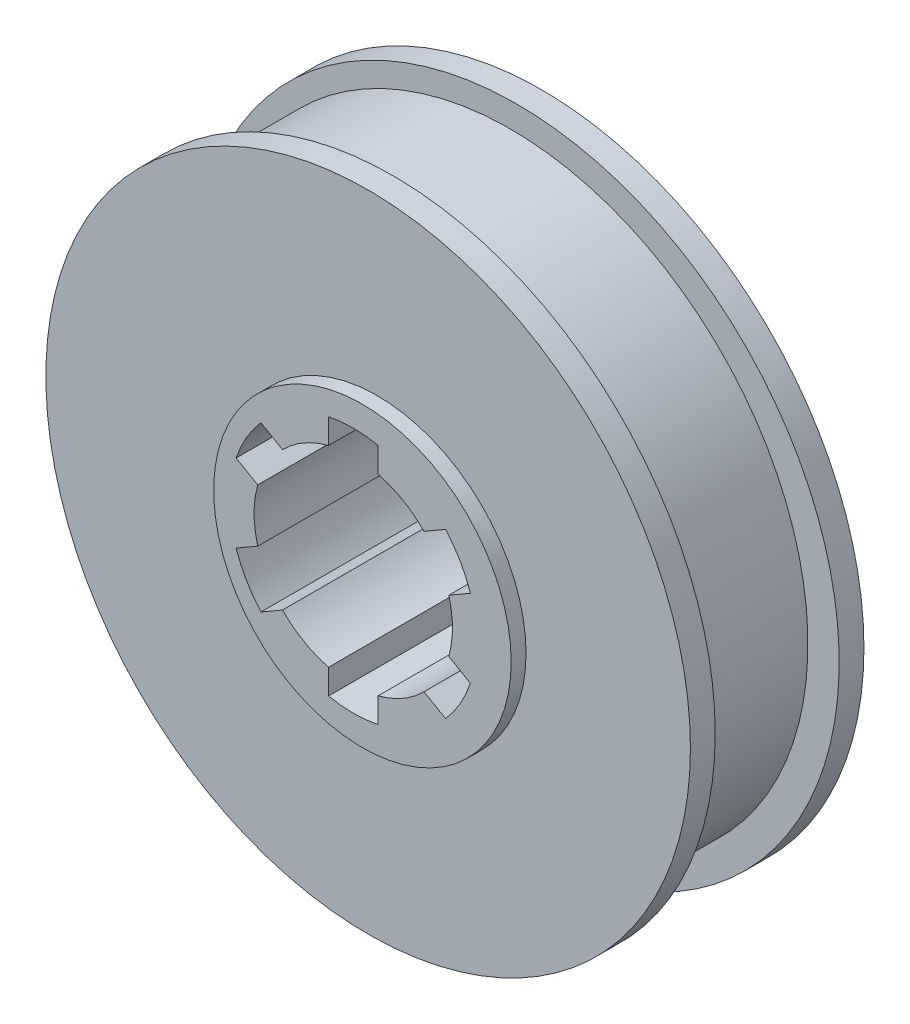
ISO-10303-21;
HEADER;
FILE_DESCRIPTION(('STEP AP214'),'2;1');
FILE_NAME('part.step','',(''),(''),'','','');
FILE_SCHEMA(('AUTOMOTIVE_DESIGN { 1 0 10303 214 1 1 1 1 }'));
ENDSEC;
DATA;
#1=APPLICATION_CONTEXT('core data for automotive mechanical design processes');
#2=APPLICATION_PROTOCOL_DEFINITION('international standard','automotive_design',2000,#1);
#3=PRODUCT_CONTEXT('',#1,'mechanical');
#4=PRODUCT('Part','Part','',(#3));
#5=PRODUCT_RELATED_PRODUCT_CATEGORY('part','',(#4));
#6=PRODUCT_DEFINITION_FORMATION('','',#4);
#7=PRODUCT_DEFINITION_CONTEXT('part definition',#1,'design');
#8=PRODUCT_DEFINITION('design','',#6,#7);
#9=PRODUCT_DEFINITION_SHAPE('','',#8);
#10=(LENGTH_UNIT() NAMED_UNIT(*) SI_UNIT(.MILLI.,.METRE.));
#11=(NAMED_UNIT(*) PLANE_ANGLE_UNIT() SI_UNIT($,.RADIAN.));
#12=(NAMED_UNIT(*) SI_UNIT($,.STERADIAN.) SOLID_ANGLE_UNIT());
#13=UNCERTAINTY_MEASURE_WITH_UNIT(LENGTH_MEASURE(1.E-05),#10,'distance_accuracy_value','');
#14=(GEOMETRIC_REPRESENTATION_CONTEXT(3) GLOBAL_UNCERTAINTY_ASSIGNED_CONTEXT((#13)) GLOBAL_UNIT_ASSIGNED_CONTEXT((#10,
#11,#12)) REPRESENTATION_CONTEXT('',''));
#15=CARTESIAN_POINT('',(0.,0.,0.));
#16=DIRECTION('',(0.,0.,1.));
#17=DIRECTION('',(1.,0.,0.));
#18=AXIS2_PLACEMENT_3D('',#15,#16,#17);
#19=CARTESIAN_POINT('',(0.129947126921392,0.,3.5));
#20=DIRECTION('',(0.,0.,-1.));
#21=DIRECTION('',(-1.,0.,0.));
#22=AXIS2_PLACEMENT_3D('',#19,#20,#21);
#23=CYLINDRICAL_SURFACE('',#22,6.5);
#24=CARTESIAN_POINT('',(0.129947126921392,0.,0.5));
#25=DIRECTION('',(0.,0.,-1.));
#26=DIRECTION('',(-1.,0.,0.));
#27=AXIS2_PLACEMENT_3D('',#24,#25,#26);
#28=CIRCLE('',#27,6.5);
#29=CARTESIAN_POINT('',(-6.37005287307861,0.,0.5));
#30=VERTEX_POINT('',#29);
#31=EDGE_CURVE('E549',#30,#30,#28,.T.);
#32=ORIENTED_EDGE('',*,*,#31,.T.);
#33=EDGE_LOOP('',(#32));
#34=FACE_BOUND('',#33,.T.);
#35=CARTESIAN_POINT('',(0.129947126921392,0.,0.));
#36=DIRECTION('',(0.,0.,1.));
#37=DIRECTION('',(1.,0.,0.));
#38=AXIS2_PLACEMENT_3D('',#35,#36,#37);
#39=CIRCLE('',#38,6.5);
#40=CARTESIAN_POINT('',(6.62994712692139,0.,0.));
#41=VERTEX_POINT('',#40);
#42=EDGE_CURVE('E293',#41,#41,#39,.T.);
#43=ORIENTED_EDGE('',*,*,#42,.T.);
#44=EDGE_LOOP('',(#43));
#45=FACE_BOUND('',#44,.T.);
#46=ADVANCED_FACE('F38',(#34,#45),#23,.T.);
#47=CARTESIAN_POINT('',(0.,0.,3.5));
#48=DIRECTION('',(0.,0.,1.));
#49=DIRECTION('',(1.,0.,0.));
#50=AXIS2_PLACEMENT_3D('',#47,#48,#49);
#51=PLANE('',#50);
#52=CARTESIAN_POINT('',(0.129947126921392,0.,3.5));
#53=DIRECTION('',(0.,0.,1.));
#54=DIRECTION('',(1.,0.,0.));
#55=AXIS2_PLACEMENT_3D('',#52,#53,#54);
#56=CIRCLE('',#55,6.5);
#57=CARTESIAN_POINT('',(6.62994712692139,0.,3.5));
#58=VERTEX_POINT('',#57);
#59=EDGE_CURVE('E202',#58,#58,#56,.T.);
#60=ORIENTED_EDGE('',*,*,#59,.T.);
#61=EDGE_LOOP('',(#60));
#62=FACE_BOUND('',#61,.T.);
#63=CARTESIAN_POINT('',(0.314947126921392,0.,3.5));
#64=DIRECTION('',(0.,0.,1.));
#65=DIRECTION('',(1.,0.,0.));
#66=AXIS2_PLACEMENT_3D('',#63,#64,#65);
#67=CIRCLE('',#66,3.);
#68=CARTESIAN_POINT('',(3.31494712692139,0.,3.5));
#69=VERTEX_POINT('',#68);
#70=EDGE_CURVE('E218',#69,#69,#67,.T.);
#71=ORIENTED_EDGE('',*,*,#70,.F.);
#72=EDGE_LOOP('',(#71));
#73=FACE_BOUND('',#72,.T.);
#74=ADVANCED_FACE('F497',(#62,#73),#51,.T.);
#75=CARTESIAN_POINT('',(0.129947126921392,0.,3.5));
#76=DIRECTION('',(0.,0.,-1.));
#77=DIRECTION('',(-1.,0.,0.));
#78=AXIS2_PLACEMENT_3D('',#75,#76,#77);
#79=CYLINDRICAL_SURFACE('',#78,2.49);
#80=CARTESIAN_POINT('',(0.129947126921392,0.,0.));
#81=DIRECTION('',(0.,0.,1.));
#82=DIRECTION('',(1.,0.,0.));
#83=AXIS2_PLACEMENT_3D('',#80,#81,#82);
#84=CIRCLE('',#83,2.49);
#85=CARTESIAN_POINT('',(1.99242789606464,-1.65265404261496,0.));
#86=VERTEX_POINT('',#85);
#87=CARTESIAN_POINT('',(2.49242789606463,-0.786628638830519,0.));
#88=VERTEX_POINT('',#87);
#89=EDGE_CURVE('E289',#86,#88,#84,.T.);
#90=ORIENTED_EDGE('',*,*,#89,.F.);
#91=DIRECTION('',(0.,0.,-1.));
#92=VECTOR('',#91,1.);
#93=CARTESIAN_POINT('',(1.99242789606464,-1.65265404261496,3.5));
#94=LINE('',#93,#92);
#95=CARTESIAN_POINT('',(1.99242789606464,-1.65265404261496,3.8));
#96=VERTEX_POINT('',#95);
#97=EDGE_CURVE('E12',#96,#86,#94,.T.);
#98=ORIENTED_EDGE('',*,*,#97,.F.);
#99=CARTESIAN_POINT('',(0.129947126921392,0.,3.8));
#100=DIRECTION('',(0.,0.,1.));
#101=DIRECTION('',(1.,0.,0.));
#102=AXIS2_PLACEMENT_3D('',#99,#100,#101);
#103=CIRCLE('',#102,2.49);
#104=CARTESIAN_POINT('',(2.49242789606464,-0.78662863883052,3.8));
#105=VERTEX_POINT('',#104);
#106=EDGE_CURVE('E205',#105,#96,#103,.F.);
#107=ORIENTED_EDGE('',*,*,#106,.F.);
#108=DIRECTION('',(0.,0.,-1.));
#109=VECTOR('',#108,1.);
#110=CARTESIAN_POINT('',(2.49242789606463,-0.786628638830519,3.5));
#111=LINE('',#110,#109);
#112=EDGE_CURVE('E53',#105,#88,#111,.T.);
#113=ORIENTED_EDGE('',*,*,#112,.T.);
#114=EDGE_LOOP('',(#90,#98,#107,#113));
#115=FACE_BOUND('',#114,.T.);
#116=ADVANCED_FACE('F206',(#115),#79,.F.);
#117=CARTESIAN_POINT('',(-0.217513218269644,-0.376743945360842,3.5));
#118=DIRECTION('',(-0.5,-0.866025403784439,0.));
#119=DIRECTION('',(0.866025403784439,-0.5,0.));
#120=AXIS2_PLACEMENT_3D('',#117,#118,#119);
#121=PLANE('',#120);
#122=DIRECTION('',(-0.866025403784439,0.5,0.));
#123=VECTOR('',#122,1.);
#124=CARTESIAN_POINT('',(-0.217513218269644,-0.376743945360842,0.));
#125=LINE('',#124,#123);
#126=CARTESIAN_POINT('',(1.55699811004625,-1.40125853844406,0.));
#127=VERTEX_POINT('',#126);
#128=EDGE_CURVE('E295',#86,#127,#125,.T.);
#129=ORIENTED_EDGE('',*,*,#128,.T.);
#130=DIRECTION('',(0.,0.,-1.));
#131=VECTOR('',#130,1.);
#132=CARTESIAN_POINT('',(1.55699811004625,-1.40125853844406,3.5));
#133=LINE('',#132,#131);
#134=CARTESIAN_POINT('',(1.55699811004625,-1.40125853844406,3.8));
#135=VERTEX_POINT('',#134);
#136=EDGE_CURVE('E46',#135,#127,#133,.T.);
#137=ORIENTED_EDGE('',*,*,#136,.F.);
#138=DIRECTION('',(-0.866025403784439,0.5,0.));
#139=VECTOR('',#138,1.);
#140=CARTESIAN_POINT('',(-0.217513218269644,-0.376743945360842,3.8));
#141=LINE('',#140,#139);
#142=EDGE_CURVE('E210',#96,#135,#141,.T.);
#143=ORIENTED_EDGE('',*,*,#142,.F.);
#144=ORIENTED_EDGE('',*,*,#97,.T.);
#145=EDGE_LOOP('',(#129,#137,#143,#144));
#146=FACE_BOUND('',#145,.T.);
#147=ADVANCED_FACE('F40',(#146),#121,.F.);
#148=CARTESIAN_POINT('',(0.129947126921392,0.,3.5));
#149=DIRECTION('',(0.,0.,-1.));
#150=DIRECTION('',(-1.,0.,0.));
#151=AXIS2_PLACEMENT_3D('',#148,#149,#150);
#152=CYLINDRICAL_SURFACE('',#151,2.);
#153=CARTESIAN_POINT('',(0.129947126921392,0.,0.));
#154=DIRECTION('',(0.,0.,1.));
#155=DIRECTION('',(1.,0.,0.));
#156=AXIS2_PLACEMENT_3D('',#153,#154,#155);
#157=CIRCLE('',#156,2.);
#158=CARTESIAN_POINT('',(0.629947126921393,-1.93649167310371,0.));
#159=VERTEX_POINT('',#158);
#160=EDGE_CURVE('E300',#159,#127,#157,.T.);
#161=ORIENTED_EDGE('',*,*,#160,.F.);
#162=DIRECTION('',(0.,0.,-1.));
#163=VECTOR('',#162,1.);
#164=CARTESIAN_POINT('',(0.629947126921393,-1.93649167310371,3.5));
#165=LINE('',#164,#163);
#166=CARTESIAN_POINT('',(0.629947126921393,-1.93649167310371,3.8));
#167=VERTEX_POINT('',#166);
#168=EDGE_CURVE('E395',#167,#159,#165,.T.);
#169=ORIENTED_EDGE('',*,*,#168,.F.);
#170=CARTESIAN_POINT('',(0.129947126921392,0.,3.8));
#171=DIRECTION('',(0.,0.,1.));
#172=DIRECTION('',(1.,0.,0.));
#173=AXIS2_PLACEMENT_3D('',#170,#171,#172);
#174=CIRCLE('',#173,2.);
#175=EDGE_CURVE('E227',#135,#167,#174,.F.);
#176=ORIENTED_EDGE('',*,*,#175,.F.);
#177=ORIENTED_EDGE('',*,*,#136,.T.);
#178=EDGE_LOOP('',(#161,#169,#176,#177));
#179=FACE_BOUND('',#178,.T.);
#180=ADVANCED_FACE('F399',(#179),#152,.F.);
#181=CARTESIAN_POINT('',(0.629947126921392,0.,3.5));
#182=DIRECTION('',(-1.,0.,0.));
#183=DIRECTION('',(0.,-1.,0.));
#184=AXIS2_PLACEMENT_3D('',#181,#182,#183);
#185=PLANE('',#184);
#186=DIRECTION('',(0.,1.,0.));
#187=VECTOR('',#186,1.);
#188=CARTESIAN_POINT('',(0.629947126921392,0.,0.));
#189=LINE('',#188,#187);
#190=CARTESIAN_POINT('',(0.629947126921393,-2.43928268144551,0.));
#191=VERTEX_POINT('',#190);
#192=EDGE_CURVE('E303',#191,#159,#189,.T.);
#193=ORIENTED_EDGE('',*,*,#192,.F.);
#194=DIRECTION('',(0.,0.,-1.));
#195=VECTOR('',#194,1.);
#196=CARTESIAN_POINT('',(0.629947126921393,-2.43928268144551,3.5));
#197=LINE('',#196,#195);
#198=CARTESIAN_POINT('',(0.629947126921393,-2.43928268144551,3.8));
#199=VERTEX_POINT('',#198);
#200=EDGE_CURVE('E393',#199,#191,#197,.T.);
#201=ORIENTED_EDGE('',*,*,#200,.F.);
#202=DIRECTION('',(0.,-1.,0.));
#203=VECTOR('',#202,1.);
#204=CARTESIAN_POINT('',(0.629947126921392,0.,3.8));
#205=LINE('',#204,#203);
#206=EDGE_CURVE('E230',#167,#199,#205,.T.);
#207=ORIENTED_EDGE('',*,*,#206,.F.);
#208=ORIENTED_EDGE('',*,*,#168,.T.);
#209=EDGE_LOOP('',(#193,#201,#207,#208));
#210=FACE_BOUND('',#209,.T.);
#211=ADVANCED_FACE('F409',(#210),#185,.T.);
#212=CARTESIAN_POINT('',(0.129947126921392,0.,3.5));
#213=DIRECTION('',(0.,0.,-1.));
#214=DIRECTION('',(-1.,0.,0.));
#215=AXIS2_PLACEMENT_3D('',#212,#213,#214);
#216=CYLINDRICAL_SURFACE('',#215,2.49);
#217=CARTESIAN_POINT('',(0.129947126921392,0.,0.));
#218=DIRECTION('',(0.,0.,1.));
#219=DIRECTION('',(1.,0.,0.));
#220=AXIS2_PLACEMENT_3D('',#217,#218,#219);
#221=CIRCLE('',#220,2.49);
#222=CARTESIAN_POINT('',(-0.370052873078607,-2.43928268144551,0.));
#223=VERTEX_POINT('',#222);
#224=EDGE_CURVE('E306',#223,#191,#221,.T.);
#225=ORIENTED_EDGE('',*,*,#224,.F.);
#226=DIRECTION('',(0.,0.,-1.));
#227=VECTOR('',#226,1.);
#228=CARTESIAN_POINT('',(-0.370052873078607,-2.43928268144551,3.5));
#229=LINE('',#228,#227);
#230=CARTESIAN_POINT('',(-0.370052873078607,-2.43928268144551,3.8));
#231=VERTEX_POINT('',#230);
#232=EDGE_CURVE('E391',#231,#223,#229,.T.);
#233=ORIENTED_EDGE('',*,*,#232,.F.);
#234=CARTESIAN_POINT('',(0.129947126921392,0.,3.8));
#235=DIRECTION('',(0.,0.,1.));
#236=DIRECTION('',(1.,0.,0.));
#237=AXIS2_PLACEMENT_3D('',#234,#235,#236);
#238=CIRCLE('',#237,2.49);
#239=EDGE_CURVE('E233',#199,#231,#238,.F.);
#240=ORIENTED_EDGE('',*,*,#239,.F.);
#241=ORIENTED_EDGE('',*,*,#200,.T.);
#242=EDGE_LOOP('',(#225,#233,#240,#241));
#243=FACE_BOUND('',#242,.T.);
#244=ADVANCED_FACE('F414',(#243),#216,.F.);
#245=CARTESIAN_POINT('',(-0.370052873078608,0.,3.5));
#246=DIRECTION('',(-1.,0.,0.));
#247=DIRECTION('',(0.,-1.,0.));
#248=AXIS2_PLACEMENT_3D('',#245,#246,#247);
#249=PLANE('',#248);
#250=DIRECTION('',(0.,1.,0.));
#251=VECTOR('',#250,1.);
#252=CARTESIAN_POINT('',(-0.370052873078608,0.,0.));
#253=LINE('',#252,#251);
#254=CARTESIAN_POINT('',(-0.370052873078607,-1.93649167310371,0.));
#255=VERTEX_POINT('',#254);
#256=EDGE_CURVE('E309',#223,#255,#253,.T.);
#257=ORIENTED_EDGE('',*,*,#256,.T.);
#258=DIRECTION('',(0.,0.,-1.));
#259=VECTOR('',#258,1.);
#260=CARTESIAN_POINT('',(-0.370052873078607,-1.93649167310371,3.5));
#261=LINE('',#260,#259);
#262=CARTESIAN_POINT('',(-0.370052873078607,-1.93649167310371,3.8));
#263=VERTEX_POINT('',#262);
#264=EDGE_CURVE('E389',#263,#255,#261,.T.);
#265=ORIENTED_EDGE('',*,*,#264,.F.);
#266=DIRECTION('',(0.,1.,0.));
#267=VECTOR('',#266,1.);
#268=CARTESIAN_POINT('',(-0.370052873078608,0.,3.8));
#269=LINE('',#268,#267);
#270=EDGE_CURVE('E236',#231,#263,#269,.T.);
#271=ORIENTED_EDGE('',*,*,#270,.F.);
#272=ORIENTED_EDGE('',*,*,#232,.T.);
#273=EDGE_LOOP('',(#257,#265,#271,#272));
#274=FACE_BOUND('',#273,.T.);
#275=ADVANCED_FACE('F416',(#274),#249,.F.);
#276=CARTESIAN_POINT('',(0.129947126921392,0.,3.5));
#277=DIRECTION('',(0.,0.,-1.));
#278=DIRECTION('',(-1.,0.,0.));
#279=AXIS2_PLACEMENT_3D('',#276,#277,#278);
#280=CYLINDRICAL_SURFACE('',#279,2.);
#281=CARTESIAN_POINT('',(0.129947126921392,0.,0.));
#282=DIRECTION('',(0.,0.,1.));
#283=DIRECTION('',(1.,0.,0.));
#284=AXIS2_PLACEMENT_3D('',#281,#282,#283);
#285=CIRCLE('',#284,2.);
#286=CARTESIAN_POINT('',(-1.29710385620346,-1.40125853844406,0.));
#287=VERTEX_POINT('',#286);
#288=EDGE_CURVE('E312',#287,#255,#285,.T.);
#289=ORIENTED_EDGE('',*,*,#288,.F.);
#290=DIRECTION('',(0.,0.,-1.));
#291=VECTOR('',#290,1.);
#292=CARTESIAN_POINT('',(-1.29710385620346,-1.40125853844406,3.5));
#293=LINE('',#292,#291);
#294=CARTESIAN_POINT('',(-1.29710385620346,-1.40125853844406,3.8));
#295=VERTEX_POINT('',#294);
#296=EDGE_CURVE('E387',#295,#287,#293,.T.);
#297=ORIENTED_EDGE('',*,*,#296,.F.);
#298=CARTESIAN_POINT('',(0.129947126921392,0.,3.8));
#299=DIRECTION('',(0.,0.,1.));
#300=DIRECTION('',(1.,0.,0.));
#301=AXIS2_PLACEMENT_3D('',#298,#299,#300);
#302=CIRCLE('',#301,2.);
#303=EDGE_CURVE('E239',#263,#295,#302,.F.);
#304=ORIENTED_EDGE('',*,*,#303,.F.);
#305=ORIENTED_EDGE('',*,*,#264,.T.);
#306=EDGE_LOOP('',(#289,#297,#304,#305));
#307=FACE_BOUND('',#306,.T.);
#308=ADVANCED_FACE('F421',(#307),#280,.F.);
#309=CARTESIAN_POINT('',(0.28248678173034,-0.489281458423568,3.5));
#310=DIRECTION('',(-0.500000000000001,0.866025403784438,0.));
#311=DIRECTION('',(-0.866025403784438,-0.500000000000001,0.));
#312=AXIS2_PLACEMENT_3D('',#309,#310,#311);
#313=PLANE('',#312);
#314=DIRECTION('',(0.866025403784438,0.500000000000001,0.));
#315=VECTOR('',#314,1.);
#316=CARTESIAN_POINT('',(0.28248678173034,-0.489281458423568,0.));
#317=LINE('',#316,#315);
#318=CARTESIAN_POINT('',(-1.73253364222185,-1.65265404261496,0.));
#319=VERTEX_POINT('',#318);
#320=EDGE_CURVE('E315',#319,#287,#317,.T.);
#321=ORIENTED_EDGE('',*,*,#320,.F.);
#322=DIRECTION('',(0.,0.,-1.));
#323=VECTOR('',#322,1.);
#324=CARTESIAN_POINT('',(-1.73253364222185,-1.65265404261496,3.5));
#325=LINE('',#324,#323);
#326=CARTESIAN_POINT('',(-1.73253364222185,-1.65265404261496,3.8));
#327=VERTEX_POINT('',#326);
#328=EDGE_CURVE('E385',#327,#319,#325,.T.);
#329=ORIENTED_EDGE('',*,*,#328,.F.);
#330=DIRECTION('',(-0.866025403784438,-0.500000000000001,0.));
#331=VECTOR('',#330,1.);
#332=CARTESIAN_POINT('',(0.28248678173034,-0.489281458423568,3.8));
#333=LINE('',#332,#331);
#334=EDGE_CURVE('E242',#295,#327,#333,.T.);
#335=ORIENTED_EDGE('',*,*,#334,.F.);
#336=ORIENTED_EDGE('',*,*,#296,.T.);
#337=EDGE_LOOP('',(#321,#329,#335,#336));
#338=FACE_BOUND('',#337,.T.);
#339=ADVANCED_FACE('F426',(#338),#313,.T.);
#340=CARTESIAN_POINT('',(-2.23253364222185,-0.786628638830521,0.));
#341=VERTEX_POINT('',#340);
#342=EDGE_CURVE('E297',#341,#319,#84,.T.);
#343=ORIENTED_EDGE('',*,*,#342,.F.);
#344=DIRECTION('',(0.,0.,-1.));
#345=VECTOR('',#344,1.);
#346=CARTESIAN_POINT('',(-2.23253364222185,-0.786628638830521,3.5));
#347=LINE('',#346,#345);
#348=CARTESIAN_POINT('',(-2.23253364222185,-0.786628638830521,3.8));
#349=VERTEX_POINT('',#348);
#350=EDGE_CURVE('E383',#349,#341,#347,.T.);
#351=ORIENTED_EDGE('',*,*,#350,.F.);
#352=CARTESIAN_POINT('',(0.129947126921392,0.,3.8));
#353=DIRECTION('',(0.,0.,1.));
#354=DIRECTION('',(1.,0.,0.));
#355=AXIS2_PLACEMENT_3D('',#352,#353,#354);
#356=CIRCLE('',#355,2.49);
#357=EDGE_CURVE('E245',#327,#349,#356,.F.);
#358=ORIENTED_EDGE('',*,*,#357,.F.);
#359=ORIENTED_EDGE('',*,*,#328,.T.);
#360=EDGE_LOOP('',(#343,#351,#358,#359));
#361=FACE_BOUND('',#360,.T.);
#362=ADVANCED_FACE('F429',(#361),#79,.F.);
#363=CARTESIAN_POINT('',(-0.21751321826966,0.37674394536087,3.5));
#364=DIRECTION('',(-0.5,0.866025403784438,0.));
#365=DIRECTION('',(-0.866025403784438,-0.5,0.));
#366=AXIS2_PLACEMENT_3D('',#363,#364,#365);
#367=PLANE('',#366);
#368=DIRECTION('',(0.866025403784438,0.5,0.));
#369=VECTOR('',#368,1.);
#370=CARTESIAN_POINT('',(-0.21751321826966,0.37674394536087,0.));
#371=LINE('',#370,#369);
#372=CARTESIAN_POINT('',(-1.79710385620345,-0.535233134659619,0.));
#373=VERTEX_POINT('',#372);
#374=EDGE_CURVE('E318',#341,#373,#371,.T.);
#375=ORIENTED_EDGE('',*,*,#374,.T.);
#376=DIRECTION('',(0.,0.,-1.));
#377=VECTOR('',#376,1.);
#378=CARTESIAN_POINT('',(-1.79710385620345,-0.535233134659619,3.5));
#379=LINE('',#378,#377);
#380=CARTESIAN_POINT('',(-1.79710385620345,-0.535233134659619,3.8));
#381=VERTEX_POINT('',#380);
#382=EDGE_CURVE('E381',#381,#373,#379,.T.);
#383=ORIENTED_EDGE('',*,*,#382,.F.);
#384=DIRECTION('',(0.866025403784438,0.5,0.));
#385=VECTOR('',#384,1.);
#386=CARTESIAN_POINT('',(-0.21751321826966,0.37674394536087,3.8));
#387=LINE('',#386,#385);
#388=EDGE_CURVE('E248',#349,#381,#387,.T.);
#389=ORIENTED_EDGE('',*,*,#388,.F.);
#390=ORIENTED_EDGE('',*,*,#350,.T.);
#391=EDGE_LOOP('',(#375,#383,#389,#390));
#392=FACE_BOUND('',#391,.T.);
#393=ADVANCED_FACE('F433',(#392),#367,.F.);
#394=CARTESIAN_POINT('',(0.129947126921392,0.,3.5));
#395=DIRECTION('',(0.,0.,-1.));
#396=DIRECTION('',(-1.,0.,0.));
#397=AXIS2_PLACEMENT_3D('',#394,#395,#396);
#398=CYLINDRICAL_SURFACE('',#397,2.);
#399=CARTESIAN_POINT('',(0.129947126921392,0.,0.));
#400=DIRECTION('',(0.,0.,1.));
#401=DIRECTION('',(1.,0.,0.));
#402=AXIS2_PLACEMENT_3D('',#399,#400,#401);
#403=CIRCLE('',#402,2.);
#404=CARTESIAN_POINT('',(-1.79710385620345,0.535233134659651,0.));
#405=VERTEX_POINT('',#404);
#406=EDGE_CURVE('E321',#405,#373,#403,.T.);
#407=ORIENTED_EDGE('',*,*,#406,.F.);
#408=DIRECTION('',(0.,0.,-1.));
#409=VECTOR('',#408,1.);
#410=CARTESIAN_POINT('',(-1.79710385620345,0.535233134659651,3.5));
#411=LINE('',#410,#409);
#412=CARTESIAN_POINT('',(-1.79710385620345,0.535233134659652,3.8));
#413=VERTEX_POINT('',#412);
#414=EDGE_CURVE('E379',#413,#405,#411,.T.);
#415=ORIENTED_EDGE('',*,*,#414,.F.);
#416=CARTESIAN_POINT('',(0.129947126921392,0.,3.8));
#417=DIRECTION('',(0.,0.,1.));
#418=DIRECTION('',(1.,0.,0.));
#419=AXIS2_PLACEMENT_3D('',#416,#417,#418);
#420=CIRCLE('',#419,2.);
#421=EDGE_CURVE('E251',#381,#413,#420,.F.);
#422=ORIENTED_EDGE('',*,*,#421,.F.);
#423=ORIENTED_EDGE('',*,*,#382,.T.);
#424=EDGE_LOOP('',(#407,#415,#422,#423));
#425=FACE_BOUND('',#424,.T.);
#426=ADVANCED_FACE('F437',(#425),#398,.F.);
#427=CARTESIAN_POINT('',(-0.217513218269644,-0.376743945360842,3.5));
#428=DIRECTION('',(0.5,0.866025403784439,0.));
#429=DIRECTION('',(-0.866025403784439,0.5,0.));
#430=AXIS2_PLACEMENT_3D('',#427,#428,#429);
#431=PLANE('',#430);
#432=DIRECTION('',(0.866025403784439,-0.5,0.));
#433=VECTOR('',#432,1.);
#434=CARTESIAN_POINT('',(-0.217513218269644,-0.376743945360842,0.));
#435=LINE('',#434,#433);
#436=CARTESIAN_POINT('',(-2.23253364222184,0.786628638830552,0.));
#437=VERTEX_POINT('',#436);
#438=EDGE_CURVE('E324',#437,#405,#435,.T.);
#439=ORIENTED_EDGE('',*,*,#438,.F.);
#440=DIRECTION('',(0.,0.,-1.));
#441=VECTOR('',#440,1.);
#442=CARTESIAN_POINT('',(-2.23253364222184,0.786628638830552,3.5));
#443=LINE('',#442,#441);
#444=CARTESIAN_POINT('',(-2.23253364222184,0.786628638830551,3.8));
#445=VERTEX_POINT('',#444);
#446=EDGE_CURVE('E377',#445,#437,#443,.T.);
#447=ORIENTED_EDGE('',*,*,#446,.F.);
#448=DIRECTION('',(-0.866025403784439,0.5,0.));
#449=VECTOR('',#448,1.);
#450=CARTESIAN_POINT('',(-0.217513218269644,-0.376743945360842,3.8));
#451=LINE('',#450,#449);
#452=EDGE_CURVE('E254',#413,#445,#451,.T.);
#453=ORIENTED_EDGE('',*,*,#452,.F.);
#454=ORIENTED_EDGE('',*,*,#414,.T.);
#455=EDGE_LOOP('',(#439,#447,#453,#454));
#456=FACE_BOUND('',#455,.T.);
#457=ADVANCED_FACE('F442',(#456),#431,.T.);
#458=CARTESIAN_POINT('',(-1.73253364222183,1.65265404261499,0.));
#459=VERTEX_POINT('',#458);
#460=EDGE_CURVE('E327',#459,#437,#84,.T.);
#461=ORIENTED_EDGE('',*,*,#460,.F.);
#462=DIRECTION('',(0.,0.,-1.));
#463=VECTOR('',#462,1.);
#464=CARTESIAN_POINT('',(-1.73253364222183,1.65265404261499,3.5));
#465=LINE('',#464,#463);
#466=CARTESIAN_POINT('',(-1.73253364222183,1.65265404261499,3.8));
#467=VERTEX_POINT('',#466);
#468=EDGE_CURVE('E375',#467,#459,#465,.T.);
#469=ORIENTED_EDGE('',*,*,#468,.F.);
#470=CARTESIAN_POINT('',(0.129947126921392,0.,3.8));
#471=DIRECTION('',(0.,0.,1.));
#472=DIRECTION('',(1.,0.,0.));
#473=AXIS2_PLACEMENT_3D('',#470,#471,#472);
#474=CIRCLE('',#473,2.49);
#475=EDGE_CURVE('E257',#445,#467,#474,.F.);
#476=ORIENTED_EDGE('',*,*,#475,.F.);
#477=ORIENTED_EDGE('',*,*,#446,.T.);
#478=EDGE_LOOP('',(#461,#469,#476,#477));
#479=FACE_BOUND('',#478,.T.);
#480=ADVANCED_FACE('F446',(#479),#79,.F.);
#481=CARTESIAN_POINT('',(0.282486781730356,0.489281458423596,3.5));
#482=DIRECTION('',(0.5,0.866025403784439,0.));
#483=DIRECTION('',(-0.866025403784439,0.5,0.));
#484=AXIS2_PLACEMENT_3D('',#481,#482,#483);
#485=PLANE('',#484);
#486=DIRECTION('',(0.866025403784439,-0.5,0.));
#487=VECTOR('',#486,1.);
#488=CARTESIAN_POINT('',(0.282486781730356,0.489281458423596,0.));
#489=LINE('',#488,#487);
#490=CARTESIAN_POINT('',(-1.29710385620344,1.40125853844409,0.));
#491=VERTEX_POINT('',#490);
#492=EDGE_CURVE('E328',#459,#491,#489,.T.);
#493=ORIENTED_EDGE('',*,*,#492,.T.);
#494=DIRECTION('',(0.,0.,-1.));
#495=VECTOR('',#494,1.);
#496=CARTESIAN_POINT('',(-1.29710385620344,1.40125853844409,3.5));
#497=LINE('',#496,#495);
#498=CARTESIAN_POINT('',(-1.29710385620344,1.40125853844409,3.8));
#499=VERTEX_POINT('',#498);
#500=EDGE_CURVE('E373',#499,#491,#497,.T.);
#501=ORIENTED_EDGE('',*,*,#500,.F.);
#502=DIRECTION('',(0.866025403784439,-0.5,0.));
#503=VECTOR('',#502,1.);
#504=CARTESIAN_POINT('',(0.282486781730356,0.489281458423596,3.8));
#505=LINE('',#504,#503);
#506=EDGE_CURVE('E260',#467,#499,#505,.T.);
#507=ORIENTED_EDGE('',*,*,#506,.F.);
#508=ORIENTED_EDGE('',*,*,#468,.T.);
#509=EDGE_LOOP('',(#493,#501,#507,#508));
#510=FACE_BOUND('',#509,.T.);
#511=ADVANCED_FACE('F450',(#510),#485,.F.);
#512=CARTESIAN_POINT('',(0.129947126921392,0.,3.5));
#513=DIRECTION('',(0.,0.,-1.));
#514=DIRECTION('',(-1.,0.,0.));
#515=AXIS2_PLACEMENT_3D('',#512,#513,#514);
#516=CYLINDRICAL_SURFACE('',#515,2.);
#517=CARTESIAN_POINT('',(0.129947126921392,0.,0.));
#518=DIRECTION('',(0.,0.,1.));
#519=DIRECTION('',(1.,0.,0.));
#520=AXIS2_PLACEMENT_3D('',#517,#518,#519);
#521=CIRCLE('',#520,2.);
#522=CARTESIAN_POINT('',(-0.370052873078608,1.93649167310371,0.));
#523=VERTEX_POINT('',#522);
#524=EDGE_CURVE('E331',#523,#491,#521,.T.);
#525=ORIENTED_EDGE('',*,*,#524,.F.);
#526=DIRECTION('',(0.,0.,-1.));
#527=VECTOR('',#526,1.);
#528=CARTESIAN_POINT('',(-0.370052873078608,1.93649167310371,3.5));
#529=LINE('',#528,#527);
#530=CARTESIAN_POINT('',(-0.370052873078608,1.93649167310371,3.8));
#531=VERTEX_POINT('',#530);
#532=EDGE_CURVE('E371',#531,#523,#529,.T.);
#533=ORIENTED_EDGE('',*,*,#532,.F.);
#534=CARTESIAN_POINT('',(0.129947126921392,0.,3.8));
#535=DIRECTION('',(0.,0.,1.));
#536=DIRECTION('',(1.,0.,0.));
#537=AXIS2_PLACEMENT_3D('',#534,#535,#536);
#538=CIRCLE('',#537,2.);
#539=EDGE_CURVE('E263',#499,#531,#538,.F.);
#540=ORIENTED_EDGE('',*,*,#539,.F.);
#541=ORIENTED_EDGE('',*,*,#500,.T.);
#542=EDGE_LOOP('',(#525,#533,#540,#541));
#543=FACE_BOUND('',#542,.T.);
#544=ADVANCED_FACE('F454',(#543),#516,.F.);
#545=CARTESIAN_POINT('',(-0.370052873078608,0.,3.5));
#546=DIRECTION('',(1.,0.,0.));
#547=DIRECTION('',(0.,1.,0.));
#548=AXIS2_PLACEMENT_3D('',#545,#546,#547);
#549=PLANE('',#548);
#550=DIRECTION('',(0.,-1.,0.));
#551=VECTOR('',#550,1.);
#552=CARTESIAN_POINT('',(-0.370052873078608,0.,0.));
#553=LINE('',#552,#551);
#554=CARTESIAN_POINT('',(-0.370052873078608,2.43928268144551,0.));
#555=VERTEX_POINT('',#554);
#556=EDGE_CURVE('E334',#555,#523,#553,.T.);
#557=ORIENTED_EDGE('',*,*,#556,.F.);
#558=DIRECTION('',(0.,0.,-1.));
#559=VECTOR('',#558,1.);
#560=CARTESIAN_POINT('',(-0.370052873078608,2.43928268144551,3.5));
#561=LINE('',#560,#559);
#562=CARTESIAN_POINT('',(-0.37005287307861,2.43928268144551,3.8));
#563=VERTEX_POINT('',#562);
#564=EDGE_CURVE('E369',#563,#555,#561,.T.);
#565=ORIENTED_EDGE('',*,*,#564,.F.);
#566=DIRECTION('',(0.,1.,0.));
#567=VECTOR('',#566,1.);
#568=CARTESIAN_POINT('',(-0.370052873078608,0.,3.8));
#569=LINE('',#568,#567);
#570=EDGE_CURVE('E266',#531,#563,#569,.T.);
#571=ORIENTED_EDGE('',*,*,#570,.F.);
#572=ORIENTED_EDGE('',*,*,#532,.T.);
#573=EDGE_LOOP('',(#557,#565,#571,#572));
#574=FACE_BOUND('',#573,.T.);
#575=ADVANCED_FACE('F459',(#574),#549,.T.);
#576=CARTESIAN_POINT('',(0.629947126921392,2.43928268144551,0.));
#577=VERTEX_POINT('',#576);
#578=EDGE_CURVE('E337',#577,#555,#84,.T.);
#579=ORIENTED_EDGE('',*,*,#578,.F.);
#580=DIRECTION('',(0.,0.,-1.));
#581=VECTOR('',#580,1.);
#582=CARTESIAN_POINT('',(0.629947126921392,2.43928268144551,3.5));
#583=LINE('',#582,#581);
#584=CARTESIAN_POINT('',(0.629947126921392,2.43928268144551,3.8));
#585=VERTEX_POINT('',#584);
#586=EDGE_CURVE('E367',#585,#577,#583,.T.);
#587=ORIENTED_EDGE('',*,*,#586,.F.);
#588=CARTESIAN_POINT('',(0.129947126921392,0.,3.8));
#589=DIRECTION('',(0.,0.,1.));
#590=DIRECTION('',(1.,0.,0.));
#591=AXIS2_PLACEMENT_3D('',#588,#589,#590);
#592=CIRCLE('',#591,2.49);
#593=EDGE_CURVE('E269',#563,#585,#592,.F.);
#594=ORIENTED_EDGE('',*,*,#593,.F.);
#595=ORIENTED_EDGE('',*,*,#564,.T.);
#596=EDGE_LOOP('',(#579,#587,#594,#595));
#597=FACE_BOUND('',#596,.T.);
#598=ADVANCED_FACE('F463',(#597),#79,.F.);
#599=CARTESIAN_POINT('',(0.629947126921392,0.,3.5));
#600=DIRECTION('',(1.,0.,0.));
#601=DIRECTION('',(0.,1.,0.));
#602=AXIS2_PLACEMENT_3D('',#599,#600,#601);
#603=PLANE('',#602);
#604=DIRECTION('',(0.,-1.,0.));
#605=VECTOR('',#604,1.);
#606=CARTESIAN_POINT('',(0.629947126921392,0.,0.));
#607=LINE('',#606,#605);
#608=CARTESIAN_POINT('',(0.629947126921392,1.93649167310371,0.));
#609=VERTEX_POINT('',#608);
#610=EDGE_CURVE('E338',#577,#609,#607,.T.);
#611=ORIENTED_EDGE('',*,*,#610,.T.);
#612=DIRECTION('',(0.,0.,-1.));
#613=VECTOR('',#612,1.);
#614=CARTESIAN_POINT('',(0.629947126921392,1.93649167310371,3.5));
#615=LINE('',#614,#613);
#616=CARTESIAN_POINT('',(0.629947126921392,1.93649167310371,3.8));
#617=VERTEX_POINT('',#616);
#618=EDGE_CURVE('E365',#617,#609,#615,.T.);
#619=ORIENTED_EDGE('',*,*,#618,.F.);
#620=DIRECTION('',(0.,-1.,0.));
#621=VECTOR('',#620,1.);
#622=CARTESIAN_POINT('',(0.629947126921392,0.,3.8));
#623=LINE('',#622,#621);
#624=EDGE_CURVE('E272',#585,#617,#623,.T.);
#625=ORIENTED_EDGE('',*,*,#624,.F.);
#626=ORIENTED_EDGE('',*,*,#586,.T.);
#627=EDGE_LOOP('',(#611,#619,#625,#626));
#628=FACE_BOUND('',#627,.T.);
#629=ADVANCED_FACE('F467',(#628),#603,.F.);
#630=CARTESIAN_POINT('',(0.129947126921392,0.,3.5));
#631=DIRECTION('',(0.,0.,-1.));
#632=DIRECTION('',(-1.,0.,0.));
#633=AXIS2_PLACEMENT_3D('',#630,#631,#632);
#634=CYLINDRICAL_SURFACE('',#633,2.);
#635=CARTESIAN_POINT('',(0.129947126921392,0.,0.));
#636=DIRECTION('',(0.,0.,1.));
#637=DIRECTION('',(1.,0.,0.));
#638=AXIS2_PLACEMENT_3D('',#635,#636,#637);
#639=CIRCLE('',#638,2.);
#640=CARTESIAN_POINT('',(1.55699811004622,1.40125853844409,0.));
#641=VERTEX_POINT('',#640);
#642=EDGE_CURVE('E341',#641,#609,#639,.T.);
#643=ORIENTED_EDGE('',*,*,#642,.F.);
#644=DIRECTION('',(0.,0.,-1.));
#645=VECTOR('',#644,1.);
#646=CARTESIAN_POINT('',(1.55699811004622,1.40125853844409,3.5));
#647=LINE('',#646,#645);
#648=CARTESIAN_POINT('',(1.55699811004622,1.40125853844409,3.8));
#649=VERTEX_POINT('',#648);
#650=EDGE_CURVE('E363',#649,#641,#647,.T.);
#651=ORIENTED_EDGE('',*,*,#650,.F.);
#652=CARTESIAN_POINT('',(0.129947126921392,0.,3.8));
#653=DIRECTION('',(0.,0.,1.));
#654=DIRECTION('',(1.,0.,0.));
#655=AXIS2_PLACEMENT_3D('',#652,#653,#654);
#656=CIRCLE('',#655,2.);
#657=EDGE_CURVE('E275',#617,#649,#656,.F.);
#658=ORIENTED_EDGE('',*,*,#657,.F.);
#659=ORIENTED_EDGE('',*,*,#618,.T.);
#660=EDGE_LOOP('',(#643,#651,#658,#659));
#661=FACE_BOUND('',#660,.T.);
#662=ADVANCED_FACE('F471',(#661),#634,.F.);
#663=CARTESIAN_POINT('',(-0.21751321826966,0.37674394536087,3.5));
#664=DIRECTION('',(0.5,-0.866025403784439,0.));
#665=DIRECTION('',(0.866025403784439,0.5,0.));
#666=AXIS2_PLACEMENT_3D('',#663,#664,#665);
#667=PLANE('',#666);
#668=DIRECTION('',(-0.866025403784439,-0.5,0.));
#669=VECTOR('',#668,1.);
#670=CARTESIAN_POINT('',(-0.21751321826966,0.37674394536087,0.));
#671=LINE('',#670,#669);
#672=CARTESIAN_POINT('',(1.99242789606462,1.65265404261499,0.));
#673=VERTEX_POINT('',#672);
#674=EDGE_CURVE('E344',#673,#641,#671,.T.);
#675=ORIENTED_EDGE('',*,*,#674,.F.);
#676=DIRECTION('',(0.,0.,-1.));
#677=VECTOR('',#676,1.);
#678=CARTESIAN_POINT('',(1.99242789606462,1.65265404261499,3.5));
#679=LINE('',#678,#677);
#680=CARTESIAN_POINT('',(1.99242789606462,1.65265404261499,3.8));
#681=VERTEX_POINT('',#680);
#682=EDGE_CURVE('E361',#681,#673,#679,.T.);
#683=ORIENTED_EDGE('',*,*,#682,.F.);
#684=DIRECTION('',(0.866025403784439,0.5,0.));
#685=VECTOR('',#684,1.);
#686=CARTESIAN_POINT('',(-0.21751321826966,0.37674394536087,3.8));
#687=LINE('',#686,#685);
#688=EDGE_CURVE('E278',#649,#681,#687,.T.);
#689=ORIENTED_EDGE('',*,*,#688,.F.);
#690=ORIENTED_EDGE('',*,*,#650,.T.);
#691=EDGE_LOOP('',(#675,#683,#689,#690));
#692=FACE_BOUND('',#691,.T.);
#693=ADVANCED_FACE('F476',(#692),#667,.T.);
#694=CARTESIAN_POINT('',(2.49242789606462,0.786628638830552,0.));
#695=VERTEX_POINT('',#694);
#696=EDGE_CURVE('E296',#695,#673,#84,.T.);
#697=ORIENTED_EDGE('',*,*,#696,.F.);
#698=DIRECTION('',(0.,0.,-1.));
#699=VECTOR('',#698,1.);
#700=CARTESIAN_POINT('',(2.49242789606462,0.786628638830552,3.5));
#701=LINE('',#700,#699);
#702=CARTESIAN_POINT('',(2.49242789606462,0.786628638830553,3.8));
#703=VERTEX_POINT('',#702);
#704=EDGE_CURVE('E359',#703,#695,#701,.T.);
#705=ORIENTED_EDGE('',*,*,#704,.F.);
#706=CARTESIAN_POINT('',(0.129947126921392,0.,3.8));
#707=DIRECTION('',(0.,0.,1.));
#708=DIRECTION('',(1.,0.,0.));
#709=AXIS2_PLACEMENT_3D('',#706,#707,#708);
#710=CIRCLE('',#709,2.49);
#711=EDGE_CURVE('E281',#681,#703,#710,.F.);
#712=ORIENTED_EDGE('',*,*,#711,.F.);
#713=ORIENTED_EDGE('',*,*,#682,.T.);
#714=EDGE_LOOP('',(#697,#705,#712,#713));
#715=FACE_BOUND('',#714,.T.);
#716=ADVANCED_FACE('F480',(#715),#79,.F.);
#717=CARTESIAN_POINT('',(0.28248678173034,-0.489281458423568,3.5));
#718=DIRECTION('',(0.5,-0.866025403784439,0.));
#719=DIRECTION('',(0.866025403784439,0.5,0.));
#720=AXIS2_PLACEMENT_3D('',#717,#718,#719);
#721=PLANE('',#720);
#722=DIRECTION('',(-0.866025403784439,-0.5,0.));
#723=VECTOR('',#722,1.);
#724=CARTESIAN_POINT('',(0.28248678173034,-0.489281458423568,0.));
#725=LINE('',#724,#723);
#726=CARTESIAN_POINT('',(2.05699811004623,0.535233134659652,0.));
#727=VERTEX_POINT('',#726);
#728=EDGE_CURVE('E347',#695,#727,#725,.T.);
#729=ORIENTED_EDGE('',*,*,#728,.T.);
#730=DIRECTION('',(0.,0.,-1.));
#731=VECTOR('',#730,1.);
#732=CARTESIAN_POINT('',(2.05699811004623,0.535233134659652,3.5));
#733=LINE('',#732,#731);
#734=CARTESIAN_POINT('',(2.05699811004623,0.535233134659653,3.8));
#735=VERTEX_POINT('',#734);
#736=EDGE_CURVE('E357',#735,#727,#733,.T.);
#737=ORIENTED_EDGE('',*,*,#736,.F.);
#738=DIRECTION('',(-0.866025403784439,-0.5,0.));
#739=VECTOR('',#738,1.);
#740=CARTESIAN_POINT('',(0.28248678173034,-0.489281458423568,3.8));
#741=LINE('',#740,#739);
#742=EDGE_CURVE('E284',#703,#735,#741,.T.);
#743=ORIENTED_EDGE('',*,*,#742,.F.);
#744=ORIENTED_EDGE('',*,*,#704,.T.);
#745=EDGE_LOOP('',(#729,#737,#743,#744));
#746=FACE_BOUND('',#745,.T.);
#747=ADVANCED_FACE('F483',(#746),#721,.F.);
#748=CARTESIAN_POINT('',(0.129947126921392,0.,3.5));
#749=DIRECTION('',(0.,0.,-1.));
#750=DIRECTION('',(-1.,0.,0.));
#751=AXIS2_PLACEMENT_3D('',#748,#749,#750);
#752=CYLINDRICAL_SURFACE('',#751,2.);
#753=CARTESIAN_POINT('',(0.129947126921392,0.,0.));
#754=DIRECTION('',(0.,0.,1.));
#755=DIRECTION('',(1.,0.,0.));
#756=AXIS2_PLACEMENT_3D('',#753,#754,#755);
#757=CIRCLE('',#756,2.);
#758=CARTESIAN_POINT('',(2.05699811004624,-0.535233134659618,0.));
#759=VERTEX_POINT('',#758);
#760=EDGE_CURVE('E350',#759,#727,#757,.T.);
#761=ORIENTED_EDGE('',*,*,#760,.F.);
#762=DIRECTION('',(0.,0.,-1.));
#763=VECTOR('',#762,1.);
#764=CARTESIAN_POINT('',(2.05699811004624,-0.535233134659618,3.5));
#765=LINE('',#764,#763);
#766=CARTESIAN_POINT('',(2.05699811004624,-0.535233134659619,3.8));
#767=VERTEX_POINT('',#766);
#768=EDGE_CURVE('E61',#767,#759,#765,.T.);
#769=ORIENTED_EDGE('',*,*,#768,.F.);
#770=CARTESIAN_POINT('',(0.129947126921392,0.,3.8));
#771=DIRECTION('',(0.,0.,1.));
#772=DIRECTION('',(1.,0.,0.));
#773=AXIS2_PLACEMENT_3D('',#770,#771,#772);
#774=CIRCLE('',#773,2.);
#775=EDGE_CURVE('E217',#735,#767,#774,.F.);
#776=ORIENTED_EDGE('',*,*,#775,.F.);
#777=ORIENTED_EDGE('',*,*,#736,.T.);
#778=EDGE_LOOP('',(#761,#769,#776,#777));
#779=FACE_BOUND('',#778,.T.);
#780=ADVANCED_FACE('F486',(#779),#752,.F.);
#781=CARTESIAN_POINT('',(0.282486781730356,0.489281458423597,3.5));
#782=DIRECTION('',(-0.5,-0.866025403784439,0.));
#783=DIRECTION('',(0.866025403784439,-0.5,0.));
#784=AXIS2_PLACEMENT_3D('',#781,#782,#783);
#785=PLANE('',#784);
#786=DIRECTION('',(-0.866025403784439,0.5,0.));
#787=VECTOR('',#786,1.);
#788=CARTESIAN_POINT('',(0.282486781730356,0.489281458423597,0.));
#789=LINE('',#788,#787);
#790=EDGE_CURVE('E201',#88,#759,#789,.T.);
#791=ORIENTED_EDGE('',*,*,#790,.F.);
#792=ORIENTED_EDGE('',*,*,#112,.F.);
#793=DIRECTION('',(0.866025403784439,-0.5,0.));
#794=VECTOR('',#793,1.);
#795=CARTESIAN_POINT('',(0.282486781730356,0.489281458423597,3.8));
#796=LINE('',#795,#794);
#797=EDGE_CURVE('E199',#767,#105,#796,.T.);
#798=ORIENTED_EDGE('',*,*,#797,.F.);
#799=ORIENTED_EDGE('',*,*,#768,.T.);
#800=EDGE_LOOP('',(#791,#792,#798,#799));
#801=FACE_BOUND('',#800,.T.);
#802=ADVANCED_FACE('F197',(#801),#785,.T.);
#803=CARTESIAN_POINT('',(0.129947126921392,0.,3.));
#804=DIRECTION('',(0.,0.,1.));
#805=DIRECTION('',(1.,0.,0.));
#806=AXIS2_PLACEMENT_3D('',#803,#804,#805);
#807=CIRCLE('',#806,6.5);
#808=CARTESIAN_POINT('',(6.62994712692139,0.,3.));
#809=VERTEX_POINT('',#808);
#810=EDGE_CURVE('E517',#809,#809,#807,.F.);
#811=ORIENTED_EDGE('',*,*,#810,.F.);
#812=EDGE_LOOP('',(#811));
#813=FACE_BOUND('',#812,.T.);
#814=ORIENTED_EDGE('',*,*,#59,.F.);
#815=EDGE_LOOP('',(#814));
#816=FACE_BOUND('',#815,.T.);
#817=ADVANCED_FACE('F493',(#813,#816),#23,.T.);
#818=CARTESIAN_POINT('',(0.,0.,0.));
#819=DIRECTION('',(0.,0.,1.));
#820=DIRECTION('',(1.,0.,0.));
#821=AXIS2_PLACEMENT_3D('',#818,#819,#820);
#822=PLANE('',#821);
#823=ORIENTED_EDGE('',*,*,#89,.T.);
#824=ORIENTED_EDGE('',*,*,#790,.T.);
#825=ORIENTED_EDGE('',*,*,#760,.T.);
#826=ORIENTED_EDGE('',*,*,#728,.F.);
#827=ORIENTED_EDGE('',*,*,#696,.T.);
#828=ORIENTED_EDGE('',*,*,#674,.T.);
#829=ORIENTED_EDGE('',*,*,#642,.T.);
#830=ORIENTED_EDGE('',*,*,#610,.F.);
#831=ORIENTED_EDGE('',*,*,#578,.T.);
#832=ORIENTED_EDGE('',*,*,#556,.T.);
#833=ORIENTED_EDGE('',*,*,#524,.T.);
#834=ORIENTED_EDGE('',*,*,#492,.F.);
#835=ORIENTED_EDGE('',*,*,#460,.T.);
#836=ORIENTED_EDGE('',*,*,#438,.T.);
#837=ORIENTED_EDGE('',*,*,#406,.T.);
#838=ORIENTED_EDGE('',*,*,#374,.F.);
#839=ORIENTED_EDGE('',*,*,#342,.T.);
#840=ORIENTED_EDGE('',*,*,#320,.T.);
#841=ORIENTED_EDGE('',*,*,#288,.T.);
#842=ORIENTED_EDGE('',*,*,#256,.F.);
#843=ORIENTED_EDGE('',*,*,#224,.T.);
#844=ORIENTED_EDGE('',*,*,#192,.T.);
#845=ORIENTED_EDGE('',*,*,#160,.T.);
#846=ORIENTED_EDGE('',*,*,#128,.F.);
#847=EDGE_LOOP('',(#823,#824,#825,#826,#827,#828,#829,#830,#831,#832,#833,#834,#835,#836,#837,
#838,#839,#840,#841,#842,#843,#844,#845,#846));
#848=FACE_BOUND('',#847,.T.);
#849=ORIENTED_EDGE('',*,*,#42,.F.);
#850=EDGE_LOOP('',(#849));
#851=FACE_BOUND('',#850,.T.);
#852=ADVANCED_FACE('F403',(#848,#851),#822,.F.);
#853=CARTESIAN_POINT('',(0.314947126921392,0.,3.8));
#854=DIRECTION('',(0.,0.,-1.));
#855=DIRECTION('',(-1.,0.,0.));
#856=AXIS2_PLACEMENT_3D('',#853,#854,#855);
#857=CYLINDRICAL_SURFACE('',#856,3.);
#858=CARTESIAN_POINT('',(0.314947126921392,0.,3.8));
#859=DIRECTION('',(0.,0.,1.));
#860=DIRECTION('',(1.,0.,0.));
#861=AXIS2_PLACEMENT_3D('',#858,#859,#860);
#862=CIRCLE('',#861,3.);
#863=CARTESIAN_POINT('',(3.31494712692139,0.,3.8));
#864=VERTEX_POINT('',#863);
#865=EDGE_CURVE('E287',#864,#864,#862,.T.);
#866=ORIENTED_EDGE('',*,*,#865,.F.);
#867=EDGE_LOOP('',(#866));
#868=FACE_BOUND('',#867,.T.);
#869=ORIENTED_EDGE('',*,*,#70,.T.);
#870=EDGE_LOOP('',(#869));
#871=FACE_BOUND('',#870,.T.);
#872=ADVANCED_FACE('F513',(#868,#871),#857,.T.);
#873=CARTESIAN_POINT('',(0.,0.,3.8));
#874=DIRECTION('',(0.,0.,1.));
#875=DIRECTION('',(1.,0.,0.));
#876=AXIS2_PLACEMENT_3D('',#873,#874,#875);
#877=PLANE('',#876);
#878=ORIENTED_EDGE('',*,*,#797,.T.);
#879=ORIENTED_EDGE('',*,*,#106,.T.);
#880=ORIENTED_EDGE('',*,*,#142,.T.);
#881=ORIENTED_EDGE('',*,*,#175,.T.);
#882=ORIENTED_EDGE('',*,*,#206,.T.);
#883=ORIENTED_EDGE('',*,*,#239,.T.);
#884=ORIENTED_EDGE('',*,*,#270,.T.);
#885=ORIENTED_EDGE('',*,*,#303,.T.);
#886=ORIENTED_EDGE('',*,*,#334,.T.);
#887=ORIENTED_EDGE('',*,*,#357,.T.);
#888=ORIENTED_EDGE('',*,*,#388,.T.);
#889=ORIENTED_EDGE('',*,*,#421,.T.);
#890=ORIENTED_EDGE('',*,*,#452,.T.);
#891=ORIENTED_EDGE('',*,*,#475,.T.);
#892=ORIENTED_EDGE('',*,*,#506,.T.);
#893=ORIENTED_EDGE('',*,*,#539,.T.);
#894=ORIENTED_EDGE('',*,*,#570,.T.);
#895=ORIENTED_EDGE('',*,*,#593,.T.);
#896=ORIENTED_EDGE('',*,*,#624,.T.);
#897=ORIENTED_EDGE('',*,*,#657,.T.);
#898=ORIENTED_EDGE('',*,*,#688,.T.);
#899=ORIENTED_EDGE('',*,*,#711,.T.);
#900=ORIENTED_EDGE('',*,*,#742,.T.);
#901=ORIENTED_EDGE('',*,*,#775,.T.);
#902=EDGE_LOOP('',(#878,#879,#880,#881,#882,#883,#884,#885,#886,#887,#888,#889,#890,#891,#892,
#893,#894,#895,#896,#897,#898,#899,#900,#901));
#903=FACE_BOUND('',#902,.T.);
#904=ORIENTED_EDGE('',*,*,#865,.T.);
#905=EDGE_LOOP('',(#904));
#906=FACE_BOUND('',#905,.T.);
#907=ADVANCED_FACE('F213',(#903,#906),#877,.T.);
#908=CARTESIAN_POINT('',(0.,0.,21.8847763108502));
#909=DIRECTION('',(0.,0.,-1.));
#910=DIRECTION('',(-1.,0.,0.));
#911=AXIS2_PLACEMENT_3D('',#908,#909,#910);
#912=CYLINDRICAL_SURFACE('',#911,6.);
#913=CARTESIAN_POINT('',(0.,0.,0.5));
#914=DIRECTION('',(0.,0.,-1.));
#915=DIRECTION('',(-1.,0.,0.));
#916=AXIS2_PLACEMENT_3D('',#913,#914,#915);
#917=CIRCLE('',#916,6.);
#918=CARTESIAN_POINT('',(-6.,0.,0.5));
#919=VERTEX_POINT('',#918);
#920=EDGE_CURVE('E547',#919,#919,#917,.T.);
#921=ORIENTED_EDGE('',*,*,#920,.F.);
#922=EDGE_LOOP('',(#921));
#923=FACE_BOUND('',#922,.T.);
#924=CARTESIAN_POINT('',(0.,0.,3.));
#925=DIRECTION('',(0.,0.,1.));
#926=DIRECTION('',(1.,0.,0.));
#927=AXIS2_PLACEMENT_3D('',#924,#925,#926);
#928=CIRCLE('',#927,6.);
#929=CARTESIAN_POINT('',(6.,0.,3.));
#930=VERTEX_POINT('',#929);
#931=EDGE_CURVE('E221',#930,#930,#928,.F.);
#932=ORIENTED_EDGE('',*,*,#931,.T.);
#933=EDGE_LOOP('',(#932));
#934=FACE_BOUND('',#933,.T.);
#935=ADVANCED_FACE('F528',(#923,#934),#912,.T.);
#936=CARTESIAN_POINT('',(0.129947126921392,0.,0.5));
#937=DIRECTION('',(0.,0.,-1.));
#938=DIRECTION('',(-1.,0.,0.));
#939=AXIS2_PLACEMENT_3D('',#936,#937,#938);
#940=PLANE('',#939);
#941=ORIENTED_EDGE('',*,*,#920,.T.);
#942=EDGE_LOOP('',(#941));
#943=FACE_BOUND('',#942,.T.);
#944=ORIENTED_EDGE('',*,*,#31,.F.);
#945=EDGE_LOOP('',(#944));
#946=FACE_BOUND('',#945,.T.);
#947=ADVANCED_FACE('F535',(#943,#946),#940,.F.);
#948=CARTESIAN_POINT('',(0.,0.,3.));
#949=DIRECTION('',(0.,0.,1.));
#950=DIRECTION('',(1.,0.,0.));
#951=AXIS2_PLACEMENT_3D('',#948,#949,#950);
#952=PLANE('',#951);
#953=ORIENTED_EDGE('',*,*,#810,.T.);
#954=EDGE_LOOP('',(#953));
#955=FACE_BOUND('',#954,.T.);
#956=ORIENTED_EDGE('',*,*,#931,.F.);
#957=EDGE_LOOP('',(#956));
#958=FACE_BOUND('',#957,.T.);
#959=ADVANCED_FACE('F532',(#955,#958),#952,.F.);
#960=CLOSED_SHELL('',(#46,#74,#116,#147,#180,#211,#244,#275,#308,#339,#362,#393,#426,#457,#480,
#511,#544,#575,#598,#629,#662,#693,#716,#747,#780,#802,#817,#852,#872,#907,#935,#947,#959));
#961=MANIFOLD_SOLID_BREP('B2',#960);
#962=ADVANCED_BREP_SHAPE_REPRESENTATION('',(#18,#961),#14);
#963=SHAPE_DEFINITION_REPRESENTATION(#9,#962);
ENDSEC;
END-ISO-10303-21;
